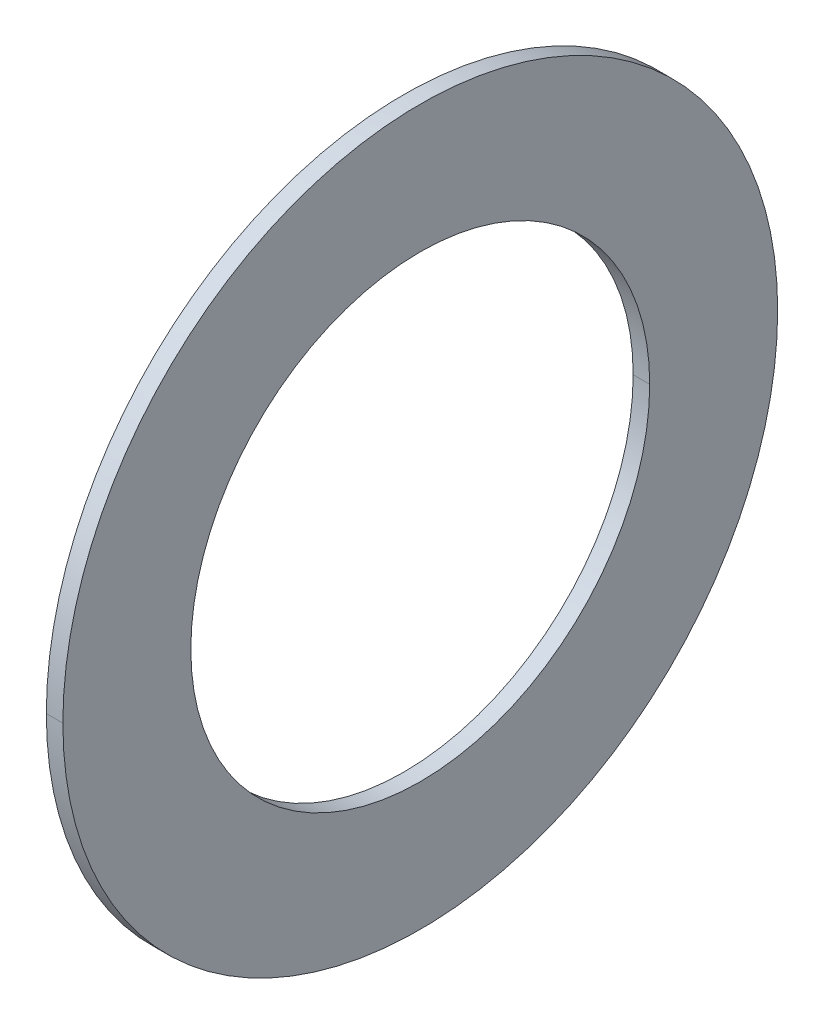
ISO-10303-21;
HEADER;
FILE_DESCRIPTION(('STEP AP214'),'2;1');
FILE_NAME('part.step','',(''),(''),'','','');
FILE_SCHEMA(('AUTOMOTIVE_DESIGN { 1 0 10303 214 1 1 1 1 }'));
ENDSEC;
DATA;
#1=APPLICATION_CONTEXT('core data for automotive mechanical design processes');
#2=APPLICATION_PROTOCOL_DEFINITION('international standard','automotive_design',2000,#1);
#3=PRODUCT_CONTEXT('',#1,'mechanical');
#4=PRODUCT('Part','Part','',(#3));
#5=PRODUCT_RELATED_PRODUCT_CATEGORY('part','',(#4));
#6=PRODUCT_DEFINITION_FORMATION('','',#4);
#7=PRODUCT_DEFINITION_CONTEXT('part definition',#1,'design');
#8=PRODUCT_DEFINITION('design','',#6,#7);
#9=PRODUCT_DEFINITION_SHAPE('','',#8);
#10=(LENGTH_UNIT() NAMED_UNIT(*) SI_UNIT(.MILLI.,.METRE.));
#11=(NAMED_UNIT(*) PLANE_ANGLE_UNIT() SI_UNIT($,.RADIAN.));
#12=(NAMED_UNIT(*) SI_UNIT($,.STERADIAN.) SOLID_ANGLE_UNIT());
#13=UNCERTAINTY_MEASURE_WITH_UNIT(LENGTH_MEASURE(1.E-05),#10,'distance_accuracy_value','');
#14=(GEOMETRIC_REPRESENTATION_CONTEXT(3) GLOBAL_UNCERTAINTY_ASSIGNED_CONTEXT((#13)) GLOBAL_UNIT_ASSIGNED_CONTEXT((#10,
#11,#12)) REPRESENTATION_CONTEXT('',''));
#15=CARTESIAN_POINT('',(0.,0.,0.));
#16=DIRECTION('',(0.,0.,1.));
#17=DIRECTION('',(1.,0.,0.));
#18=AXIS2_PLACEMENT_3D('',#15,#16,#17);
#19=CARTESIAN_POINT('',(0.25,4.05,0.));
#20=DIRECTION('',(-1.,0.,0.));
#21=DIRECTION('',(0.,0.,1.));
#22=AXIS2_PLACEMENT_3D('',#19,#20,#21);
#23=PLANE('',#22);
#24=CARTESIAN_POINT('',(0.25,0.,0.));
#25=DIRECTION('',(1.,0.,0.));
#26=DIRECTION('',(0.,0.,-1.));
#27=AXIS2_PLACEMENT_3D('',#24,#25,#26);
#28=CIRCLE('',#27,2.6);
#29=CARTESIAN_POINT('',(0.25,0.,-2.6));
#30=VERTEX_POINT('',#29);
#31=CARTESIAN_POINT('',(0.25,0.,2.6));
#32=VERTEX_POINT('',#31);
#33=EDGE_CURVE('E11',#30,#32,#28,.T.);
#34=ORIENTED_EDGE('',*,*,#33,.T.);
#35=CARTESIAN_POINT('',(0.25,0.,0.));
#36=DIRECTION('',(1.,0.,0.));
#37=DIRECTION('',(0.,0.,-1.));
#38=AXIS2_PLACEMENT_3D('',#35,#36,#37);
#39=CIRCLE('',#38,2.6);
#40=EDGE_CURVE('E25',#32,#30,#39,.T.);
#41=ORIENTED_EDGE('',*,*,#40,.T.);
#42=EDGE_LOOP('',(#34,#41));
#43=FACE_BOUND('',#42,.T.);
#44=CARTESIAN_POINT('',(0.25,0.,0.));
#45=DIRECTION('',(1.,0.,0.));
#46=DIRECTION('',(0.,0.,-1.));
#47=AXIS2_PLACEMENT_3D('',#44,#45,#46);
#48=CIRCLE('',#47,4.05);
#49=CARTESIAN_POINT('',(0.25,0.,-4.05));
#50=VERTEX_POINT('',#49);
#51=CARTESIAN_POINT('',(0.25,0.,4.05));
#52=VERTEX_POINT('',#51);
#53=EDGE_CURVE('E96',#50,#52,#48,.T.);
#54=ORIENTED_EDGE('',*,*,#53,.F.);
#55=CARTESIAN_POINT('',(0.25,0.,0.));
#56=DIRECTION('',(1.,0.,0.));
#57=DIRECTION('',(0.,0.,-1.));
#58=AXIS2_PLACEMENT_3D('',#55,#56,#57);
#59=CIRCLE('',#58,4.05);
#60=EDGE_CURVE('E91',#52,#50,#59,.T.);
#61=ORIENTED_EDGE('',*,*,#60,.F.);
#62=EDGE_LOOP('',(#54,#61));
#63=FACE_BOUND('',#62,.T.);
#64=ADVANCED_FACE('F17',(#43,#63),#23,.T.);
#65=CARTESIAN_POINT('',(0.4374,0.,0.));
#66=DIRECTION('',(-1.,0.,0.));
#67=DIRECTION('',(0.,1.,0.));
#68=AXIS2_PLACEMENT_3D('',#65,#66,#67);
#69=CYLINDRICAL_SURFACE('',#68,4.05);
#70=ORIENTED_EDGE('',*,*,#60,.T.);
#71=DIRECTION('',(-1.,0.,0.));
#72=VECTOR('',#71,1.);
#73=CARTESIAN_POINT('',(0.4374,0.,-4.05));
#74=LINE('',#73,#72);
#75=CARTESIAN_POINT('',(0.4374,0.,-4.05));
#76=VERTEX_POINT('',#75);
#77=EDGE_CURVE('E86',#76,#50,#74,.T.);
#78=ORIENTED_EDGE('',*,*,#77,.F.);
#79=CARTESIAN_POINT('',(0.4374,0.,0.));
#80=DIRECTION('',(1.,0.,0.));
#81=DIRECTION('',(0.,0.,-1.));
#82=AXIS2_PLACEMENT_3D('',#79,#80,#81);
#83=CIRCLE('',#82,4.05);
#84=CARTESIAN_POINT('',(0.4374,0.,4.05));
#85=VERTEX_POINT('',#84);
#86=EDGE_CURVE('E81',#85,#76,#83,.T.);
#87=ORIENTED_EDGE('',*,*,#86,.F.);
#88=DIRECTION('',(-1.,0.,0.));
#89=VECTOR('',#88,1.);
#90=CARTESIAN_POINT('',(0.4374,0.,4.05));
#91=LINE('',#90,#89);
#92=EDGE_CURVE('E70',#85,#52,#91,.T.);
#93=ORIENTED_EDGE('',*,*,#92,.T.);
#94=EDGE_LOOP('',(#70,#78,#87,#93));
#95=FACE_BOUND('',#94,.T.);
#96=ADVANCED_FACE('F111',(#95),#69,.T.);
#97=CARTESIAN_POINT('',(0.4374,0.,0.));
#98=DIRECTION('',(-1.,0.,0.));
#99=DIRECTION('',(0.,-1.,0.));
#100=AXIS2_PLACEMENT_3D('',#97,#98,#99);
#101=CYLINDRICAL_SURFACE('',#100,4.05);
#102=CARTESIAN_POINT('',(0.4374,0.,0.));
#103=DIRECTION('',(1.,0.,0.));
#104=DIRECTION('',(0.,0.,-1.));
#105=AXIS2_PLACEMENT_3D('',#102,#103,#104);
#106=CIRCLE('',#105,4.05);
#107=EDGE_CURVE('E67',#76,#85,#106,.T.);
#108=ORIENTED_EDGE('',*,*,#107,.F.);
#109=ORIENTED_EDGE('',*,*,#77,.T.);
#110=ORIENTED_EDGE('',*,*,#53,.T.);
#111=ORIENTED_EDGE('',*,*,#92,.F.);
#112=EDGE_LOOP('',(#108,#109,#110,#111));
#113=FACE_BOUND('',#112,.T.);
#114=ADVANCED_FACE('F108',(#113),#101,.T.);
#115=CARTESIAN_POINT('',(0.4374,2.6,0.));
#116=DIRECTION('',(1.,0.,0.));
#117=DIRECTION('',(0.,0.,-1.));
#118=AXIS2_PLACEMENT_3D('',#115,#116,#117);
#119=PLANE('',#118);
#120=ORIENTED_EDGE('',*,*,#107,.T.);
#121=ORIENTED_EDGE('',*,*,#86,.T.);
#122=EDGE_LOOP('',(#120,#121));
#123=FACE_BOUND('',#122,.T.);
#124=CARTESIAN_POINT('',(0.4374,0.,0.));
#125=DIRECTION('',(1.,0.,0.));
#126=DIRECTION('',(0.,0.,-1.));
#127=AXIS2_PLACEMENT_3D('',#124,#125,#126);
#128=CIRCLE('',#127,2.6);
#129=CARTESIAN_POINT('',(0.4374,0.,-2.6));
#130=VERTEX_POINT('',#129);
#131=CARTESIAN_POINT('',(0.4374,0.,2.6));
#132=VERTEX_POINT('',#131);
#133=EDGE_CURVE('E56',#130,#132,#128,.T.);
#134=ORIENTED_EDGE('',*,*,#133,.F.);
#135=CARTESIAN_POINT('',(0.4374,0.,0.));
#136=DIRECTION('',(1.,0.,0.));
#137=DIRECTION('',(0.,0.,-1.));
#138=AXIS2_PLACEMENT_3D('',#135,#136,#137);
#139=CIRCLE('',#138,2.6);
#140=EDGE_CURVE('E52',#132,#130,#139,.T.);
#141=ORIENTED_EDGE('',*,*,#140,.F.);
#142=EDGE_LOOP('',(#134,#141));
#143=FACE_BOUND('',#142,.T.);
#144=ADVANCED_FACE('F54',(#123,#143),#119,.T.);
#145=CARTESIAN_POINT('',(0.4374,0.,0.));
#146=DIRECTION('',(-1.,0.,0.));
#147=DIRECTION('',(0.,1.,0.));
#148=AXIS2_PLACEMENT_3D('',#145,#146,#147);
#149=CYLINDRICAL_SURFACE('',#148,2.6);
#150=ORIENTED_EDGE('',*,*,#40,.F.);
#151=DIRECTION('',(-1.,0.,0.));
#152=VECTOR('',#151,1.);
#153=CARTESIAN_POINT('',(0.4374,0.,2.6));
#154=LINE('',#153,#152);
#155=EDGE_CURVE('E59',#132,#32,#154,.T.);
#156=ORIENTED_EDGE('',*,*,#155,.F.);
#157=ORIENTED_EDGE('',*,*,#140,.T.);
#158=DIRECTION('',(-1.,0.,0.));
#159=VECTOR('',#158,1.);
#160=CARTESIAN_POINT('',(0.4374,0.,-2.6));
#161=LINE('',#160,#159);
#162=EDGE_CURVE('E64',#130,#30,#161,.T.);
#163=ORIENTED_EDGE('',*,*,#162,.T.);
#164=EDGE_LOOP('',(#150,#156,#157,#163));
#165=FACE_BOUND('',#164,.T.);
#166=ADVANCED_FACE('F62',(#165),#149,.F.);
#167=CARTESIAN_POINT('',(0.4374,0.,0.));
#168=DIRECTION('',(-1.,0.,0.));
#169=DIRECTION('',(0.,-1.,0.));
#170=AXIS2_PLACEMENT_3D('',#167,#168,#169);
#171=CYLINDRICAL_SURFACE('',#170,2.6);
#172=ORIENTED_EDGE('',*,*,#133,.T.);
#173=ORIENTED_EDGE('',*,*,#155,.T.);
#174=ORIENTED_EDGE('',*,*,#33,.F.);
#175=ORIENTED_EDGE('',*,*,#162,.F.);
#176=EDGE_LOOP('',(#172,#173,#174,#175));
#177=FACE_BOUND('',#176,.T.);
#178=ADVANCED_FACE('F66',(#177),#171,.F.);
#179=CLOSED_SHELL('',(#64,#96,#114,#144,#166,#178));
#180=MANIFOLD_SOLID_BREP('B1',#179);
#181=ADVANCED_BREP_SHAPE_REPRESENTATION('',(#18,#180),#14);
#182=SHAPE_DEFINITION_REPRESENTATION(#9,#181);
ENDSEC;
END-ISO-10303-21;
